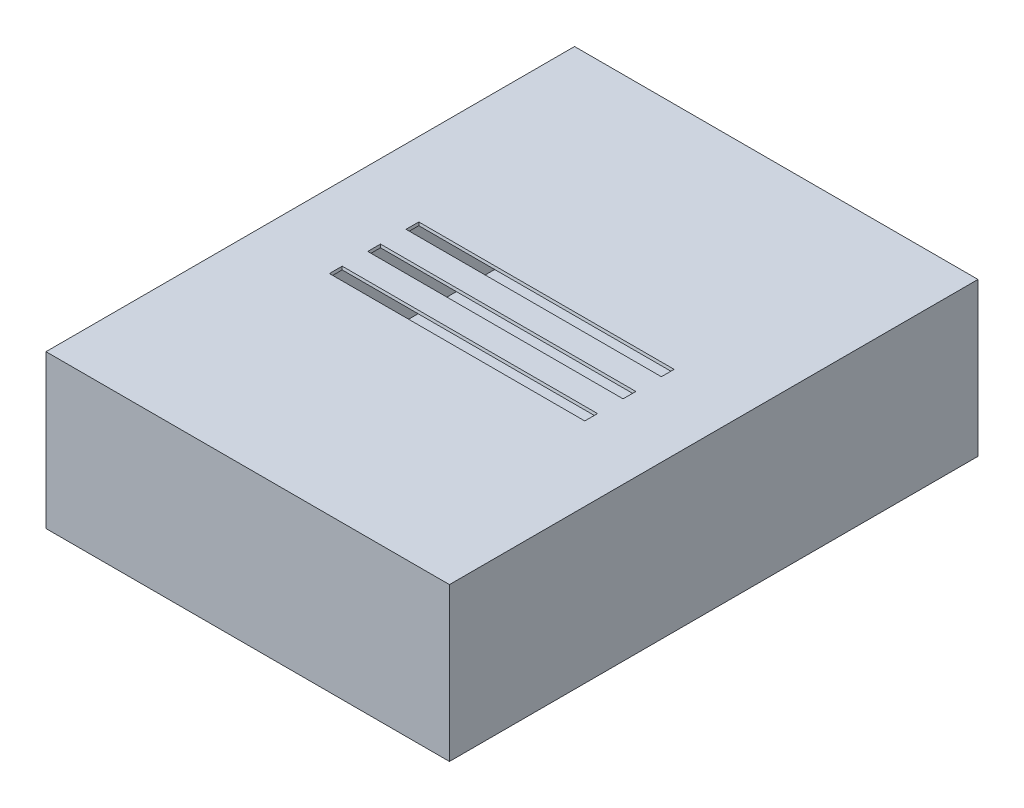
ISO-10303-21;
HEADER;
FILE_DESCRIPTION(('STEP AP214'),'2;1');
FILE_NAME('part.step','',(''),(''),'','','');
FILE_SCHEMA(('AUTOMOTIVE_DESIGN { 1 0 10303 214 1 1 1 1 }'));
ENDSEC;
DATA;
#1=APPLICATION_CONTEXT('core data for automotive mechanical design processes');
#2=APPLICATION_PROTOCOL_DEFINITION('international standard','automotive_design',2000,#1);
#3=PRODUCT_CONTEXT('',#1,'mechanical');
#4=PRODUCT('Part','Part','',(#3));
#5=PRODUCT_RELATED_PRODUCT_CATEGORY('part','',(#4));
#6=PRODUCT_DEFINITION_FORMATION('','',#4);
#7=PRODUCT_DEFINITION_CONTEXT('part definition',#1,'design');
#8=PRODUCT_DEFINITION('design','',#6,#7);
#9=PRODUCT_DEFINITION_SHAPE('','',#8);
#10=(LENGTH_UNIT() NAMED_UNIT(*) SI_UNIT(.MILLI.,.METRE.));
#11=(NAMED_UNIT(*) PLANE_ANGLE_UNIT() SI_UNIT($,.RADIAN.));
#12=(NAMED_UNIT(*) SI_UNIT($,.STERADIAN.) SOLID_ANGLE_UNIT());
#13=UNCERTAINTY_MEASURE_WITH_UNIT(LENGTH_MEASURE(1.E-05),#10,'distance_accuracy_value','');
#14=(GEOMETRIC_REPRESENTATION_CONTEXT(3) GLOBAL_UNCERTAINTY_ASSIGNED_CONTEXT((#13)) GLOBAL_UNIT_ASSIGNED_CONTEXT((#10,
#11,#12)) REPRESENTATION_CONTEXT('',''));
#15=CARTESIAN_POINT('',(0.,0.,0.));
#16=DIRECTION('',(0.,0.,1.));
#17=DIRECTION('',(1.,0.,0.));
#18=AXIS2_PLACEMENT_3D('',#15,#16,#17);
#19=CARTESIAN_POINT('',(0.,149.86,0.));
#20=DIRECTION('',(0.,1.,0.));
#21=DIRECTION('',(0.,0.,1.));
#22=AXIS2_PLACEMENT_3D('',#19,#20,#21);
#23=PLANE('',#22);
#24=DIRECTION('',(-1.,0.,0.));
#25=VECTOR('',#24,1.);
#26=CARTESIAN_POINT('',(73.66,149.86,305.480590948775));
#27=LINE('',#26,#25);
#28=CARTESIAN_POINT('',(326.979409051225,149.86,305.480590948775));
#29=VERTEX_POINT('',#28);
#30=CARTESIAN_POINT('',(74.340590948775,149.86,305.480590948775));
#31=VERTEX_POINT('',#30);
#32=EDGE_CURVE('E255',#29,#31,#27,.T.);
#33=ORIENTED_EDGE('',*,*,#32,.T.);
#34=DIRECTION('',(0.,0.,1.));
#35=VECTOR('',#34,1.);
#36=CARTESIAN_POINT('',(74.340590948775,149.86,317.5));
#37=LINE('',#36,#35);
#38=CARTESIAN_POINT('',(74.340590948775,149.86,316.819409051225));
#39=VERTEX_POINT('',#38);
#40=EDGE_CURVE('E246',#31,#39,#37,.T.);
#41=ORIENTED_EDGE('',*,*,#40,.T.);
#42=DIRECTION('',(1.,0.,0.));
#43=VECTOR('',#42,1.);
#44=CARTESIAN_POINT('',(73.66,149.86,316.819409051225));
#45=LINE('',#44,#43);
#46=CARTESIAN_POINT('',(326.979409051225,149.86,316.819409051225));
#47=VERTEX_POINT('',#46);
#48=EDGE_CURVE('E263',#39,#47,#45,.T.);
#49=ORIENTED_EDGE('',*,*,#48,.T.);
#50=DIRECTION('',(0.,0.,-1.));
#51=VECTOR('',#50,1.);
#52=CARTESIAN_POINT('',(326.979409051225,149.86,317.5));
#53=LINE('',#52,#51);
#54=EDGE_CURVE('E267',#47,#29,#53,.T.);
#55=ORIENTED_EDGE('',*,*,#54,.T.);
#56=EDGE_LOOP('',(#33,#41,#49,#55));
#57=FACE_BOUND('',#56,.T.);
#58=DIRECTION('',(-1.,0.,0.));
#59=VECTOR('',#58,1.);
#60=CARTESIAN_POINT('',(73.66,149.86,229.280590948775));
#61=LINE('',#60,#59);
#62=CARTESIAN_POINT('',(326.979409051225,149.86,229.280590948775));
#63=VERTEX_POINT('',#62);
#64=CARTESIAN_POINT('',(74.340590948775,149.86,229.280590948775));
#65=VERTEX_POINT('',#64);
#66=EDGE_CURVE('E216',#63,#65,#61,.T.);
#67=ORIENTED_EDGE('',*,*,#66,.T.);
#68=DIRECTION('',(0.,0.,1.));
#69=VECTOR('',#68,1.);
#70=CARTESIAN_POINT('',(74.340590948775,149.86,241.3));
#71=LINE('',#70,#69);
#72=CARTESIAN_POINT('',(74.340590948775,149.86,240.619409051225));
#73=VERTEX_POINT('',#72);
#74=EDGE_CURVE('E207',#65,#73,#71,.T.);
#75=ORIENTED_EDGE('',*,*,#74,.T.);
#76=DIRECTION('',(1.,0.,0.));
#77=VECTOR('',#76,1.);
#78=CARTESIAN_POINT('',(73.66,149.86,240.619409051225));
#79=LINE('',#78,#77);
#80=CARTESIAN_POINT('',(326.979409051225,149.86,240.619409051225));
#81=VERTEX_POINT('',#80);
#82=EDGE_CURVE('E223',#73,#81,#79,.T.);
#83=ORIENTED_EDGE('',*,*,#82,.T.);
#84=DIRECTION('',(0.,0.,-1.));
#85=VECTOR('',#84,1.);
#86=CARTESIAN_POINT('',(326.979409051225,149.86,241.3));
#87=LINE('',#86,#85);
#88=EDGE_CURVE('E186',#81,#63,#87,.T.);
#89=ORIENTED_EDGE('',*,*,#88,.T.);
#90=EDGE_LOOP('',(#67,#75,#83,#89));
#91=FACE_BOUND('',#90,.T.);
#92=DIRECTION('',(-1.,0.,0.));
#93=VECTOR('',#92,1.);
#94=CARTESIAN_POINT('',(73.66,149.86,267.380590948775));
#95=LINE('',#94,#93);
#96=CARTESIAN_POINT('',(326.979409051225,149.86,267.380590948775));
#97=VERTEX_POINT('',#96);
#98=CARTESIAN_POINT('',(74.340590948775,149.86,267.380590948775));
#99=VERTEX_POINT('',#98);
#100=EDGE_CURVE('E298',#97,#99,#95,.T.);
#101=ORIENTED_EDGE('',*,*,#100,.T.);
#102=DIRECTION('',(0.,0.,1.));
#103=VECTOR('',#102,1.);
#104=CARTESIAN_POINT('',(74.340590948775,149.86,279.4));
#105=LINE('',#104,#103);
#106=CARTESIAN_POINT('',(74.340590948775,149.86,278.719409051225));
#107=VERTEX_POINT('',#106);
#108=EDGE_CURVE('E289',#99,#107,#105,.T.);
#109=ORIENTED_EDGE('',*,*,#108,.T.);
#110=DIRECTION('',(1.,0.,0.));
#111=VECTOR('',#110,1.);
#112=CARTESIAN_POINT('',(73.66,149.86,278.719409051225));
#113=LINE('',#112,#111);
#114=CARTESIAN_POINT('',(326.979409051225,149.86,278.719409051225));
#115=VERTEX_POINT('',#114);
#116=EDGE_CURVE('E306',#107,#115,#113,.T.);
#117=ORIENTED_EDGE('',*,*,#116,.T.);
#118=DIRECTION('',(0.,0.,-1.));
#119=VECTOR('',#118,1.);
#120=CARTESIAN_POINT('',(326.979409051225,149.86,279.4));
#121=LINE('',#120,#119);
#122=EDGE_CURVE('E310',#115,#97,#121,.T.);
#123=ORIENTED_EDGE('',*,*,#122,.T.);
#124=EDGE_LOOP('',(#101,#109,#117,#123));
#125=FACE_BOUND('',#124,.T.);
#126=DIRECTION('',(0.,0.,1.));
#127=VECTOR('',#126,1.);
#128=CARTESIAN_POINT('',(2.54,149.86,25.4));
#129=LINE('',#128,#127);
#130=CARTESIAN_POINT('',(2.54,149.86,25.4));
#131=VERTEX_POINT('',#130);
#132=CARTESIAN_POINT('',(2.54,149.86,523.24));
#133=VERTEX_POINT('',#132);
#134=EDGE_CURVE('E214',#131,#133,#129,.T.);
#135=ORIENTED_EDGE('',*,*,#134,.F.);
#136=DIRECTION('',(1.,0.,0.));
#137=VECTOR('',#136,1.);
#138=CARTESIAN_POINT('',(2.54,149.86,25.4));
#139=LINE('',#138,#137);
#140=CARTESIAN_POINT('',(398.78,149.86,25.4));
#141=VERTEX_POINT('',#140);
#142=EDGE_CURVE('E327',#131,#141,#139,.T.);
#143=ORIENTED_EDGE('',*,*,#142,.T.);
#144=DIRECTION('',(0.,0.,1.));
#145=VECTOR('',#144,1.);
#146=CARTESIAN_POINT('',(398.78,149.86,25.4));
#147=LINE('',#146,#145);
#148=CARTESIAN_POINT('',(398.78,149.86,523.24));
#149=VERTEX_POINT('',#148);
#150=EDGE_CURVE('E323',#141,#149,#147,.T.);
#151=ORIENTED_EDGE('',*,*,#150,.T.);
#152=DIRECTION('',(1.,0.,0.));
#153=VECTOR('',#152,1.);
#154=CARTESIAN_POINT('',(2.54,149.86,523.24));
#155=LINE('',#154,#153);
#156=EDGE_CURVE('E320',#133,#149,#155,.T.);
#157=ORIENTED_EDGE('',*,*,#156,.F.);
#158=EDGE_LOOP('',(#135,#143,#151,#157));
#159=FACE_BOUND('',#158,.T.);
#160=ADVANCED_FACE('F41',(#57,#91,#125,#159),#23,.F.);
#161=CARTESIAN_POINT('',(0.,2.54000000000001,0.));
#162=DIRECTION('',(0.,-1.,0.));
#163=DIRECTION('',(0.,0.,-1.));
#164=AXIS2_PLACEMENT_3D('',#161,#162,#163);
#165=PLANE('',#164);
#166=DIRECTION('',(0.,0.,-1.));
#167=VECTOR('',#166,1.);
#168=CARTESIAN_POINT('',(2.54,2.54000000000001,523.24));
#169=LINE('',#168,#167);
#170=CARTESIAN_POINT('',(2.54,2.54000000000001,523.24));
#171=VERTEX_POINT('',#170);
#172=CARTESIAN_POINT('',(2.54,2.54000000000001,25.4));
#173=VERTEX_POINT('',#172);
#174=EDGE_CURVE('E331',#171,#173,#169,.T.);
#175=ORIENTED_EDGE('',*,*,#174,.F.);
#176=DIRECTION('',(1.,0.,0.));
#177=VECTOR('',#176,1.);
#178=CARTESIAN_POINT('',(2.54,2.54000000000001,523.24));
#179=LINE('',#178,#177);
#180=CARTESIAN_POINT('',(398.78,2.54000000000001,523.24));
#181=VERTEX_POINT('',#180);
#182=EDGE_CURVE('E342',#171,#181,#179,.T.);
#183=ORIENTED_EDGE('',*,*,#182,.T.);
#184=DIRECTION('',(0.,0.,-1.));
#185=VECTOR('',#184,1.);
#186=CARTESIAN_POINT('',(398.78,2.54000000000001,523.24));
#187=LINE('',#186,#185);
#188=CARTESIAN_POINT('',(398.78,2.54000000000001,25.4));
#189=VERTEX_POINT('',#188);
#190=EDGE_CURVE('E338',#181,#189,#187,.T.);
#191=ORIENTED_EDGE('',*,*,#190,.T.);
#192=DIRECTION('',(1.,0.,0.));
#193=VECTOR('',#192,1.);
#194=CARTESIAN_POINT('',(2.54,2.54000000000001,25.4));
#195=LINE('',#194,#193);
#196=EDGE_CURVE('E335',#173,#189,#195,.T.);
#197=ORIENTED_EDGE('',*,*,#196,.F.);
#198=EDGE_LOOP('',(#175,#183,#191,#197));
#199=FACE_BOUND('',#198,.T.);
#200=ADVANCED_FACE('F423',(#199),#165,.F.);
#201=CARTESIAN_POINT('',(2.54,2.54000000000001,523.24));
#202=DIRECTION('',(0.,0.,1.));
#203=DIRECTION('',(1.,0.,0.));
#204=AXIS2_PLACEMENT_3D('',#201,#202,#203);
#205=PLANE('',#204);
#206=ORIENTED_EDGE('',*,*,#156,.T.);
#207=DIRECTION('',(0.,1.,0.));
#208=VECTOR('',#207,1.);
#209=CARTESIAN_POINT('',(398.78,2.54000000000001,523.24));
#210=LINE('',#209,#208);
#211=EDGE_CURVE('E349',#181,#149,#210,.T.);
#212=ORIENTED_EDGE('',*,*,#211,.F.);
#213=ORIENTED_EDGE('',*,*,#182,.F.);
#214=DIRECTION('',(0.,1.,0.));
#215=VECTOR('',#214,1.);
#216=CARTESIAN_POINT('',(2.54,2.54000000000001,523.24));
#217=LINE('',#216,#215);
#218=EDGE_CURVE('E346',#171,#133,#217,.T.);
#219=ORIENTED_EDGE('',*,*,#218,.T.);
#220=EDGE_LOOP('',(#206,#212,#213,#219));
#221=FACE_BOUND('',#220,.T.);
#222=ADVANCED_FACE('F429',(#221),#205,.F.);
#223=CARTESIAN_POINT('',(398.78,2.54000000000001,523.24));
#224=DIRECTION('',(1.,0.,0.));
#225=DIRECTION('',(0.,0.,-1.));
#226=AXIS2_PLACEMENT_3D('',#223,#224,#225);
#227=PLANE('',#226);
#228=ORIENTED_EDGE('',*,*,#150,.F.);
#229=DIRECTION('',(0.,1.,0.));
#230=VECTOR('',#229,1.);
#231=CARTESIAN_POINT('',(398.78,2.54000000000001,25.4));
#232=LINE('',#231,#230);
#233=EDGE_CURVE('E353',#189,#141,#232,.T.);
#234=ORIENTED_EDGE('',*,*,#233,.F.);
#235=ORIENTED_EDGE('',*,*,#190,.F.);
#236=ORIENTED_EDGE('',*,*,#211,.T.);
#237=EDGE_LOOP('',(#228,#234,#235,#236));
#238=FACE_BOUND('',#237,.T.);
#239=ADVANCED_FACE('F439',(#238),#227,.F.);
#240=CARTESIAN_POINT('',(2.54,2.54000000000001,25.4));
#241=DIRECTION('',(0.,0.,1.));
#242=DIRECTION('',(1.,0.,0.));
#243=AXIS2_PLACEMENT_3D('',#240,#241,#242);
#244=PLANE('',#243);
#245=ORIENTED_EDGE('',*,*,#233,.T.);
#246=ORIENTED_EDGE('',*,*,#142,.F.);
#247=DIRECTION('',(0.,1.,0.));
#248=VECTOR('',#247,1.);
#249=CARTESIAN_POINT('',(2.54,2.54000000000001,25.4));
#250=LINE('',#249,#248);
#251=EDGE_CURVE('E357',#173,#131,#250,.T.);
#252=ORIENTED_EDGE('',*,*,#251,.F.);
#253=ORIENTED_EDGE('',*,*,#196,.T.);
#254=EDGE_LOOP('',(#245,#246,#252,#253));
#255=FACE_BOUND('',#254,.T.);
#256=ADVANCED_FACE('F443',(#255),#244,.T.);
#257=CARTESIAN_POINT('',(2.54,2.54000000000001,523.24));
#258=DIRECTION('',(1.,0.,0.));
#259=DIRECTION('',(0.,0.,-1.));
#260=AXIS2_PLACEMENT_3D('',#257,#258,#259);
#261=PLANE('',#260);
#262=ORIENTED_EDGE('',*,*,#251,.T.);
#263=ORIENTED_EDGE('',*,*,#134,.T.);
#264=ORIENTED_EDGE('',*,*,#218,.F.);
#265=ORIENTED_EDGE('',*,*,#174,.T.);
#266=EDGE_LOOP('',(#262,#263,#264,#265));
#267=FACE_BOUND('',#266,.T.);
#268=ADVANCED_FACE('F447',(#267),#261,.T.);
#269=CARTESIAN_POINT('',(73.66,152.4,279.4));
#270=DIRECTION('',(-0.965925826289068,-0.258819045102521,0.));
#271=DIRECTION('',(0.258819045102521,-0.965925826289068,0.));
#272=AXIS2_PLACEMENT_3D('',#269,#270,#271);
#273=PLANE('',#272);
#274=DIRECTION('',(0.,0.,1.));
#275=VECTOR('',#274,1.);
#276=CARTESIAN_POINT('',(73.66,152.4,279.4));
#277=LINE('',#276,#275);
#278=CARTESIAN_POINT('',(73.66,152.4,266.7));
#279=VERTEX_POINT('',#278);
#280=CARTESIAN_POINT('',(73.66,152.4,279.4));
#281=VERTEX_POINT('',#280);
#282=EDGE_CURVE('E274',#279,#281,#277,.T.);
#283=ORIENTED_EDGE('',*,*,#282,.T.);
#284=DIRECTION('',(-0.250562807085732,0.935113126531029,0.250562807085732));
#285=VECTOR('',#284,1.);
#286=CARTESIAN_POINT('',(73.66,152.4,279.4));
#287=LINE('',#286,#285);
#288=EDGE_CURVE('E293',#107,#281,#287,.T.);
#289=ORIENTED_EDGE('',*,*,#288,.F.);
#290=ORIENTED_EDGE('',*,*,#108,.F.);
#291=DIRECTION('',(-0.250562807085732,0.935113126531029,-0.250562807085732));
#292=VECTOR('',#291,1.);
#293=CARTESIAN_POINT('',(73.66,152.4,266.7));
#294=LINE('',#293,#292);
#295=EDGE_CURVE('E234',#99,#279,#294,.T.);
#296=ORIENTED_EDGE('',*,*,#295,.T.);
#297=EDGE_LOOP('',(#283,#289,#290,#296));
#298=FACE_BOUND('',#297,.T.);
#299=ADVANCED_FACE('F451',(#298),#273,.F.);
#300=CARTESIAN_POINT('',(73.66,152.4,266.7));
#301=DIRECTION('',(0.,-0.258819045102521,-0.965925826289068));
#302=DIRECTION('',(0.,0.965925826289068,-0.258819045102521));
#303=AXIS2_PLACEMENT_3D('',#300,#301,#302);
#304=PLANE('',#303);
#305=DIRECTION('',(-1.,0.,0.));
#306=VECTOR('',#305,1.);
#307=CARTESIAN_POINT('',(73.66,152.4,266.7));
#308=LINE('',#307,#306);
#309=CARTESIAN_POINT('',(327.66,152.4,266.7));
#310=VERTEX_POINT('',#309);
#311=EDGE_CURVE('E285',#310,#279,#308,.T.);
#312=ORIENTED_EDGE('',*,*,#311,.T.);
#313=ORIENTED_EDGE('',*,*,#295,.F.);
#314=ORIENTED_EDGE('',*,*,#100,.F.);
#315=DIRECTION('',(0.250562807085732,0.935113126531029,-0.250562807085732));
#316=VECTOR('',#315,1.);
#317=CARTESIAN_POINT('',(326.862672152258,149.424331961936,267.497327847742));
#318=LINE('',#317,#316);
#319=EDGE_CURVE('E292',#97,#310,#318,.T.);
#320=ORIENTED_EDGE('',*,*,#319,.T.);
#321=EDGE_LOOP('',(#312,#313,#314,#320));
#322=FACE_BOUND('',#321,.T.);
#323=ADVANCED_FACE('F434',(#322),#304,.F.);
#324=CARTESIAN_POINT('',(327.66,152.4,279.4));
#325=DIRECTION('',(0.965925826289068,-0.258819045102521,0.));
#326=DIRECTION('',(0.258819045102521,0.965925826289068,0.));
#327=AXIS2_PLACEMENT_3D('',#324,#325,#326);
#328=PLANE('',#327);
#329=DIRECTION('',(0.,0.,-1.));
#330=VECTOR('',#329,1.);
#331=CARTESIAN_POINT('',(327.66,152.4,279.4));
#332=LINE('',#331,#330);
#333=CARTESIAN_POINT('',(327.66,152.4,279.4));
#334=VERTEX_POINT('',#333);
#335=EDGE_CURVE('E281',#334,#310,#332,.T.);
#336=ORIENTED_EDGE('',*,*,#335,.T.);
#337=ORIENTED_EDGE('',*,*,#319,.F.);
#338=ORIENTED_EDGE('',*,*,#122,.F.);
#339=DIRECTION('',(0.250562807085732,0.935113126531029,0.250562807085732));
#340=VECTOR('',#339,1.);
#341=CARTESIAN_POINT('',(311.713443045151,92.8866392387122,263.453443045151));
#342=LINE('',#341,#340);
#343=EDGE_CURVE('E297',#115,#334,#342,.T.);
#344=ORIENTED_EDGE('',*,*,#343,.T.);
#345=EDGE_LOOP('',(#336,#337,#338,#344));
#346=FACE_BOUND('',#345,.T.);
#347=ADVANCED_FACE('F493',(#346),#328,.F.);
#348=CARTESIAN_POINT('',(73.66,152.4,279.4));
#349=DIRECTION('',(0.,-0.258819045102521,0.965925826289068));
#350=DIRECTION('',(0.,-0.965925826289068,-0.258819045102521));
#351=AXIS2_PLACEMENT_3D('',#348,#349,#350);
#352=PLANE('',#351);
#353=DIRECTION('',(1.,0.,0.));
#354=VECTOR('',#353,1.);
#355=CARTESIAN_POINT('',(73.66,152.4,279.4));
#356=LINE('',#355,#354);
#357=EDGE_CURVE('E277',#281,#334,#356,.T.);
#358=ORIENTED_EDGE('',*,*,#357,.T.);
#359=ORIENTED_EDGE('',*,*,#343,.F.);
#360=ORIENTED_EDGE('',*,*,#116,.F.);
#361=ORIENTED_EDGE('',*,*,#288,.T.);
#362=EDGE_LOOP('',(#358,#359,#360,#361));
#363=FACE_BOUND('',#362,.T.);
#364=ADVANCED_FACE('F491',(#363),#352,.F.);
#365=CARTESIAN_POINT('',(73.66,152.4,241.3));
#366=DIRECTION('',(-0.965925826289068,-0.258819045102521,0.));
#367=DIRECTION('',(0.258819045102521,-0.965925826289068,0.));
#368=AXIS2_PLACEMENT_3D('',#365,#366,#367);
#369=PLANE('',#368);
#370=DIRECTION('',(0.,0.,1.));
#371=VECTOR('',#370,1.);
#372=CARTESIAN_POINT('',(73.66,152.4,241.3));
#373=LINE('',#372,#371);
#374=CARTESIAN_POINT('',(73.66,152.4,228.6));
#375=VERTEX_POINT('',#374);
#376=CARTESIAN_POINT('',(73.66,152.4,241.3));
#377=VERTEX_POINT('',#376);
#378=EDGE_CURVE('E57',#375,#377,#373,.T.);
#379=ORIENTED_EDGE('',*,*,#378,.T.);
#380=DIRECTION('',(-0.250562807085732,0.935113126531029,0.250562807085732));
#381=VECTOR('',#380,1.);
#382=CARTESIAN_POINT('',(73.66,152.4,241.3));
#383=LINE('',#382,#381);
#384=EDGE_CURVE('E192',#73,#377,#383,.T.);
#385=ORIENTED_EDGE('',*,*,#384,.F.);
#386=ORIENTED_EDGE('',*,*,#74,.F.);
#387=DIRECTION('',(-0.250562807085732,0.935113126531029,-0.250562807085732));
#388=VECTOR('',#387,1.);
#389=CARTESIAN_POINT('',(73.66,152.4,228.6));
#390=LINE('',#389,#388);
#391=EDGE_CURVE('E211',#65,#375,#390,.T.);
#392=ORIENTED_EDGE('',*,*,#391,.T.);
#393=EDGE_LOOP('',(#379,#385,#386,#392));
#394=FACE_BOUND('',#393,.T.);
#395=ADVANCED_FACE('F469',(#394),#369,.F.);
#396=CARTESIAN_POINT('',(73.66,152.4,228.6));
#397=DIRECTION('',(0.,-0.258819045102521,-0.965925826289068));
#398=DIRECTION('',(0.,0.965925826289068,-0.258819045102521));
#399=AXIS2_PLACEMENT_3D('',#396,#397,#398);
#400=PLANE('',#399);
#401=DIRECTION('',(-1.,0.,0.));
#402=VECTOR('',#401,1.);
#403=CARTESIAN_POINT('',(73.66,152.4,228.6));
#404=LINE('',#403,#402);
#405=CARTESIAN_POINT('',(327.66,152.4,228.6));
#406=VERTEX_POINT('',#405);
#407=EDGE_CURVE('E203',#406,#375,#404,.T.);
#408=ORIENTED_EDGE('',*,*,#407,.T.);
#409=ORIENTED_EDGE('',*,*,#391,.F.);
#410=ORIENTED_EDGE('',*,*,#66,.F.);
#411=DIRECTION('',(0.250562807085732,0.935113126531029,-0.250562807085732));
#412=VECTOR('',#411,1.);
#413=CARTESIAN_POINT('',(326.862672152258,149.424331961936,229.397327847742));
#414=LINE('',#413,#412);
#415=EDGE_CURVE('E191',#63,#406,#414,.T.);
#416=ORIENTED_EDGE('',*,*,#415,.T.);
#417=EDGE_LOOP('',(#408,#409,#410,#416));
#418=FACE_BOUND('',#417,.T.);
#419=ADVANCED_FACE('F466',(#418),#400,.F.);
#420=CARTESIAN_POINT('',(327.66,152.4,241.3));
#421=DIRECTION('',(0.965925826289068,-0.258819045102521,0.));
#422=DIRECTION('',(0.258819045102521,0.965925826289068,0.));
#423=AXIS2_PLACEMENT_3D('',#420,#421,#422);
#424=PLANE('',#423);
#425=DIRECTION('',(0.,0.,-1.));
#426=VECTOR('',#425,1.);
#427=CARTESIAN_POINT('',(327.66,152.4,241.3));
#428=LINE('',#427,#426);
#429=CARTESIAN_POINT('',(327.66,152.4,241.3));
#430=VERTEX_POINT('',#429);
#431=EDGE_CURVE('E183',#430,#406,#428,.T.);
#432=ORIENTED_EDGE('',*,*,#431,.T.);
#433=ORIENTED_EDGE('',*,*,#415,.F.);
#434=ORIENTED_EDGE('',*,*,#88,.F.);
#435=DIRECTION('',(0.250562807085732,0.935113126531029,0.250562807085732));
#436=VECTOR('',#435,1.);
#437=CARTESIAN_POINT('',(311.713443045151,92.8866392387122,225.353443045151));
#438=LINE('',#437,#436);
#439=EDGE_CURVE('E179',#81,#430,#438,.T.);
#440=ORIENTED_EDGE('',*,*,#439,.T.);
#441=EDGE_LOOP('',(#432,#433,#434,#440));
#442=FACE_BOUND('',#441,.T.);
#443=ADVANCED_FACE('F181',(#442),#424,.F.);
#444=CARTESIAN_POINT('',(73.66,152.4,241.3));
#445=DIRECTION('',(0.,-0.258819045102521,0.965925826289068));
#446=DIRECTION('',(0.,-0.965925826289068,-0.258819045102521));
#447=AXIS2_PLACEMENT_3D('',#444,#445,#446);
#448=PLANE('',#447);
#449=DIRECTION('',(1.,0.,0.));
#450=VECTOR('',#449,1.);
#451=CARTESIAN_POINT('',(73.66,152.4,241.3));
#452=LINE('',#451,#450);
#453=EDGE_CURVE('E195',#377,#430,#452,.T.);
#454=ORIENTED_EDGE('',*,*,#453,.T.);
#455=ORIENTED_EDGE('',*,*,#439,.F.);
#456=ORIENTED_EDGE('',*,*,#82,.F.);
#457=ORIENTED_EDGE('',*,*,#384,.T.);
#458=EDGE_LOOP('',(#454,#455,#456,#457));
#459=FACE_BOUND('',#458,.T.);
#460=ADVANCED_FACE('F196',(#459),#448,.F.);
#461=CARTESIAN_POINT('',(0.,152.4,525.78));
#462=DIRECTION('',(0.,-1.,0.));
#463=DIRECTION('',(0.,0.,-1.));
#464=AXIS2_PLACEMENT_3D('',#461,#462,#463);
#465=PLANE('',#464);
#466=ORIENTED_EDGE('',*,*,#453,.F.);
#467=ORIENTED_EDGE('',*,*,#378,.F.);
#468=ORIENTED_EDGE('',*,*,#407,.F.);
#469=ORIENTED_EDGE('',*,*,#431,.F.);
#470=EDGE_LOOP('',(#466,#467,#468,#469));
#471=FACE_BOUND('',#470,.T.);
#472=DIRECTION('',(1.,0.,0.));
#473=VECTOR('',#472,1.);
#474=CARTESIAN_POINT('',(73.66,152.4,317.5));
#475=LINE('',#474,#473);
#476=CARTESIAN_POINT('',(73.66,152.4,317.5));
#477=VERTEX_POINT('',#476);
#478=CARTESIAN_POINT('',(327.66,152.4,317.5));
#479=VERTEX_POINT('',#478);
#480=EDGE_CURVE('E233',#477,#479,#475,.T.);
#481=ORIENTED_EDGE('',*,*,#480,.F.);
#482=DIRECTION('',(0.,0.,1.));
#483=VECTOR('',#482,1.);
#484=CARTESIAN_POINT('',(73.66,152.4,317.5));
#485=LINE('',#484,#483);
#486=CARTESIAN_POINT('',(73.66,152.4,304.8));
#487=VERTEX_POINT('',#486);
#488=EDGE_CURVE('E65',#487,#477,#485,.T.);
#489=ORIENTED_EDGE('',*,*,#488,.F.);
#490=DIRECTION('',(-1.,0.,0.));
#491=VECTOR('',#490,1.);
#492=CARTESIAN_POINT('',(73.66,152.4,304.8));
#493=LINE('',#492,#491);
#494=CARTESIAN_POINT('',(327.66,152.4,304.8));
#495=VERTEX_POINT('',#494);
#496=EDGE_CURVE('E242',#495,#487,#493,.T.);
#497=ORIENTED_EDGE('',*,*,#496,.F.);
#498=DIRECTION('',(0.,0.,-1.));
#499=VECTOR('',#498,1.);
#500=CARTESIAN_POINT('',(327.66,152.4,317.5));
#501=LINE('',#500,#499);
#502=EDGE_CURVE('E238',#479,#495,#501,.T.);
#503=ORIENTED_EDGE('',*,*,#502,.F.);
#504=EDGE_LOOP('',(#481,#489,#497,#503));
#505=FACE_BOUND('',#504,.T.);
#506=ORIENTED_EDGE('',*,*,#357,.F.);
#507=ORIENTED_EDGE('',*,*,#282,.F.);
#508=ORIENTED_EDGE('',*,*,#311,.F.);
#509=ORIENTED_EDGE('',*,*,#335,.F.);
#510=EDGE_LOOP('',(#506,#507,#508,#509));
#511=FACE_BOUND('',#510,.T.);
#512=DIRECTION('',(-1.,0.,0.));
#513=VECTOR('',#512,1.);
#514=CARTESIAN_POINT('',(0.,152.4,0.));
#515=LINE('',#514,#513);
#516=CARTESIAN_POINT('',(401.32,152.4,0.));
#517=VERTEX_POINT('',#516);
#518=CARTESIAN_POINT('',(0.,152.4,0.));
#519=VERTEX_POINT('',#518);
#520=EDGE_CURVE('E367',#517,#519,#515,.T.);
#521=ORIENTED_EDGE('',*,*,#520,.T.);
#522=DIRECTION('',(0.,0.,-1.));
#523=VECTOR('',#522,1.);
#524=CARTESIAN_POINT('',(0.,152.4,525.78));
#525=LINE('',#524,#523);
#526=CARTESIAN_POINT('',(0.,152.4,525.78));
#527=VERTEX_POINT('',#526);
#528=EDGE_CURVE('E376',#527,#519,#525,.T.);
#529=ORIENTED_EDGE('',*,*,#528,.F.);
#530=DIRECTION('',(-1.,0.,0.));
#531=VECTOR('',#530,1.);
#532=CARTESIAN_POINT('',(0.,152.4,525.78));
#533=LINE('',#532,#531);
#534=CARTESIAN_POINT('',(401.32,152.4,525.78));
#535=VERTEX_POINT('',#534);
#536=EDGE_CURVE('E373',#535,#527,#533,.T.);
#537=ORIENTED_EDGE('',*,*,#536,.F.);
#538=DIRECTION('',(0.,0.,-1.));
#539=VECTOR('',#538,1.);
#540=CARTESIAN_POINT('',(401.32,152.4,525.78));
#541=LINE('',#540,#539);
#542=EDGE_CURVE('E391',#535,#517,#541,.T.);
#543=ORIENTED_EDGE('',*,*,#542,.T.);
#544=EDGE_LOOP('',(#521,#529,#537,#543));
#545=FACE_BOUND('',#544,.T.);
#546=ADVANCED_FACE('F200',(#471,#505,#511,#545),#465,.F.);
#547=CARTESIAN_POINT('',(0.,0.,525.78));
#548=DIRECTION('',(1.,0.,0.));
#549=DIRECTION('',(0.,0.,-1.));
#550=AXIS2_PLACEMENT_3D('',#547,#548,#549);
#551=PLANE('',#550);
#552=DIRECTION('',(0.,-1.,0.));
#553=VECTOR('',#552,1.);
#554=CARTESIAN_POINT('',(0.,0.,0.));
#555=LINE('',#554,#553);
#556=CARTESIAN_POINT('',(0.,0.,0.));
#557=VERTEX_POINT('',#556);
#558=EDGE_CURVE('E361',#519,#557,#555,.T.);
#559=ORIENTED_EDGE('',*,*,#558,.T.);
#560=DIRECTION('',(0.,0.,-1.));
#561=VECTOR('',#560,1.);
#562=CARTESIAN_POINT('',(0.,0.,525.78));
#563=LINE('',#562,#561);
#564=CARTESIAN_POINT('',(0.,0.,525.78));
#565=VERTEX_POINT('',#564);
#566=EDGE_CURVE('E11',#565,#557,#563,.T.);
#567=ORIENTED_EDGE('',*,*,#566,.F.);
#568=DIRECTION('',(0.,-1.,0.));
#569=VECTOR('',#568,1.);
#570=CARTESIAN_POINT('',(0.,0.,525.78));
#571=LINE('',#570,#569);
#572=EDGE_CURVE('E362',#527,#565,#571,.T.);
#573=ORIENTED_EDGE('',*,*,#572,.F.);
#574=ORIENTED_EDGE('',*,*,#528,.T.);
#575=EDGE_LOOP('',(#559,#567,#573,#574));
#576=FACE_BOUND('',#575,.T.);
#577=ADVANCED_FACE('F43',(#576),#551,.F.);
#578=CARTESIAN_POINT('',(0.,0.,525.78));
#579=DIRECTION('',(0.,1.,0.));
#580=DIRECTION('',(0.,0.,1.));
#581=AXIS2_PLACEMENT_3D('',#578,#579,#580);
#582=PLANE('',#581);
#583=DIRECTION('',(1.,0.,0.));
#584=VECTOR('',#583,1.);
#585=CARTESIAN_POINT('',(0.,0.,0.));
#586=LINE('',#585,#584);
#587=CARTESIAN_POINT('',(401.32,0.,0.));
#588=VERTEX_POINT('',#587);
#589=EDGE_CURVE('E380',#557,#588,#586,.T.);
#590=ORIENTED_EDGE('',*,*,#589,.T.);
#591=DIRECTION('',(0.,0.,-1.));
#592=VECTOR('',#591,1.);
#593=CARTESIAN_POINT('',(401.32,0.,525.78));
#594=LINE('',#593,#592);
#595=CARTESIAN_POINT('',(401.32,0.,525.78));
#596=VERTEX_POINT('',#595);
#597=EDGE_CURVE('E50',#596,#588,#594,.T.);
#598=ORIENTED_EDGE('',*,*,#597,.F.);
#599=DIRECTION('',(1.,0.,0.));
#600=VECTOR('',#599,1.);
#601=CARTESIAN_POINT('',(0.,0.,525.78));
#602=LINE('',#601,#600);
#603=EDGE_CURVE('E366',#565,#596,#602,.T.);
#604=ORIENTED_EDGE('',*,*,#603,.F.);
#605=ORIENTED_EDGE('',*,*,#566,.T.);
#606=EDGE_LOOP('',(#590,#598,#604,#605));
#607=FACE_BOUND('',#606,.T.);
#608=ADVANCED_FACE('F415',(#607),#582,.F.);
#609=CARTESIAN_POINT('',(401.32,0.,525.78));
#610=DIRECTION('',(-1.,0.,0.));
#611=DIRECTION('',(0.,0.,1.));
#612=AXIS2_PLACEMENT_3D('',#609,#610,#611);
#613=PLANE('',#612);
#614=DIRECTION('',(0.,1.,0.));
#615=VECTOR('',#614,1.);
#616=CARTESIAN_POINT('',(401.32,0.,0.));
#617=LINE('',#616,#615);
#618=EDGE_CURVE('E383',#588,#517,#617,.T.);
#619=ORIENTED_EDGE('',*,*,#618,.T.);
#620=ORIENTED_EDGE('',*,*,#542,.F.);
#621=DIRECTION('',(0.,1.,0.));
#622=VECTOR('',#621,1.);
#623=CARTESIAN_POINT('',(401.32,0.,525.78));
#624=LINE('',#623,#622);
#625=EDGE_CURVE('E370',#596,#535,#624,.T.);
#626=ORIENTED_EDGE('',*,*,#625,.F.);
#627=ORIENTED_EDGE('',*,*,#597,.T.);
#628=EDGE_LOOP('',(#619,#620,#626,#627));
#629=FACE_BOUND('',#628,.T.);
#630=ADVANCED_FACE('F400',(#629),#613,.F.);
#631=CARTESIAN_POINT('',(0.,0.,525.78));
#632=DIRECTION('',(0.,0.,-1.));
#633=DIRECTION('',(-1.,0.,0.));
#634=AXIS2_PLACEMENT_3D('',#631,#632,#633);
#635=PLANE('',#634);
#636=ORIENTED_EDGE('',*,*,#572,.T.);
#637=ORIENTED_EDGE('',*,*,#603,.T.);
#638=ORIENTED_EDGE('',*,*,#625,.T.);
#639=ORIENTED_EDGE('',*,*,#536,.T.);
#640=EDGE_LOOP('',(#636,#637,#638,#639));
#641=FACE_BOUND('',#640,.T.);
#642=ADVANCED_FACE('F414',(#641),#635,.F.);
#643=CARTESIAN_POINT('',(0.,0.,0.));
#644=DIRECTION('',(0.,0.,-1.));
#645=DIRECTION('',(-1.,0.,0.));
#646=AXIS2_PLACEMENT_3D('',#643,#644,#645);
#647=PLANE('',#646);
#648=ORIENTED_EDGE('',*,*,#558,.F.);
#649=ORIENTED_EDGE('',*,*,#520,.F.);
#650=ORIENTED_EDGE('',*,*,#618,.F.);
#651=ORIENTED_EDGE('',*,*,#589,.F.);
#652=EDGE_LOOP('',(#648,#649,#650,#651));
#653=FACE_BOUND('',#652,.T.);
#654=ADVANCED_FACE('F406',(#653),#647,.T.);
#655=CARTESIAN_POINT('',(73.66,152.4,317.5));
#656=DIRECTION('',(-0.965925826289068,-0.258819045102521,0.));
#657=DIRECTION('',(0.258819045102521,-0.965925826289068,0.));
#658=AXIS2_PLACEMENT_3D('',#655,#656,#657);
#659=PLANE('',#658);
#660=ORIENTED_EDGE('',*,*,#488,.T.);
#661=DIRECTION('',(-0.250562807085732,0.935113126531029,0.250562807085732));
#662=VECTOR('',#661,1.);
#663=CARTESIAN_POINT('',(73.66,152.4,317.5));
#664=LINE('',#663,#662);
#665=EDGE_CURVE('E251',#39,#477,#664,.T.);
#666=ORIENTED_EDGE('',*,*,#665,.F.);
#667=ORIENTED_EDGE('',*,*,#40,.F.);
#668=DIRECTION('',(-0.250562807085732,0.935113126531029,-0.250562807085732));
#669=VECTOR('',#668,1.);
#670=CARTESIAN_POINT('',(73.66,152.4,304.8));
#671=LINE('',#670,#669);
#672=EDGE_CURVE('E247',#31,#487,#671,.T.);
#673=ORIENTED_EDGE('',*,*,#672,.T.);
#674=EDGE_LOOP('',(#660,#666,#667,#673));
#675=FACE_BOUND('',#674,.T.);
#676=ADVANCED_FACE('F457',(#675),#659,.F.);
#677=CARTESIAN_POINT('',(73.66,152.4,304.8));
#678=DIRECTION('',(0.,-0.258819045102521,-0.965925826289068));
#679=DIRECTION('',(0.,0.965925826289068,-0.258819045102521));
#680=AXIS2_PLACEMENT_3D('',#677,#678,#679);
#681=PLANE('',#680);
#682=ORIENTED_EDGE('',*,*,#496,.T.);
#683=ORIENTED_EDGE('',*,*,#672,.F.);
#684=ORIENTED_EDGE('',*,*,#32,.F.);
#685=DIRECTION('',(0.250562807085732,0.935113126531029,-0.250562807085732));
#686=VECTOR('',#685,1.);
#687=CARTESIAN_POINT('',(326.862672152258,149.424331961936,305.597327847742));
#688=LINE('',#687,#686);
#689=EDGE_CURVE('E250',#29,#495,#688,.T.);
#690=ORIENTED_EDGE('',*,*,#689,.T.);
#691=EDGE_LOOP('',(#682,#683,#684,#690));
#692=FACE_BOUND('',#691,.T.);
#693=ADVANCED_FACE('F476',(#692),#681,.F.);
#694=CARTESIAN_POINT('',(327.66,152.4,317.5));
#695=DIRECTION('',(0.965925826289068,-0.258819045102521,0.));
#696=DIRECTION('',(0.258819045102521,0.965925826289068,0.));
#697=AXIS2_PLACEMENT_3D('',#694,#695,#696);
#698=PLANE('',#697);
#699=ORIENTED_EDGE('',*,*,#502,.T.);
#700=ORIENTED_EDGE('',*,*,#689,.F.);
#701=ORIENTED_EDGE('',*,*,#54,.F.);
#702=DIRECTION('',(0.250562807085732,0.935113126531029,0.250562807085732));
#703=VECTOR('',#702,1.);
#704=CARTESIAN_POINT('',(311.713443045151,92.8866392387122,301.553443045151));
#705=LINE('',#704,#703);
#706=EDGE_CURVE('E254',#47,#479,#705,.T.);
#707=ORIENTED_EDGE('',*,*,#706,.T.);
#708=EDGE_LOOP('',(#699,#700,#701,#707));
#709=FACE_BOUND('',#708,.T.);
#710=ADVANCED_FACE('F480',(#709),#698,.F.);
#711=CARTESIAN_POINT('',(73.66,152.4,317.5));
#712=DIRECTION('',(0.,-0.258819045102521,0.965925826289068));
#713=DIRECTION('',(0.,-0.965925826289068,-0.258819045102521));
#714=AXIS2_PLACEMENT_3D('',#711,#712,#713);
#715=PLANE('',#714);
#716=ORIENTED_EDGE('',*,*,#480,.T.);
#717=ORIENTED_EDGE('',*,*,#706,.F.);
#718=ORIENTED_EDGE('',*,*,#48,.F.);
#719=ORIENTED_EDGE('',*,*,#665,.T.);
#720=EDGE_LOOP('',(#716,#717,#718,#719));
#721=FACE_BOUND('',#720,.T.);
#722=ADVANCED_FACE('F477',(#721),#715,.F.);
#723=CLOSED_SHELL('',(#160,#200,#222,#239,#256,#268,#299,#323,#347,#364,#395,#419,#443,#460,
#546,#577,#608,#630,#642,#654,#676,#693,#710,#722));
#724=MANIFOLD_SOLID_BREP('B2',#723);
#725=ADVANCED_BREP_SHAPE_REPRESENTATION('',(#18,#724),#14);
#726=SHAPE_DEFINITION_REPRESENTATION(#9,#725);
ENDSEC;
END-ISO-10303-21;
